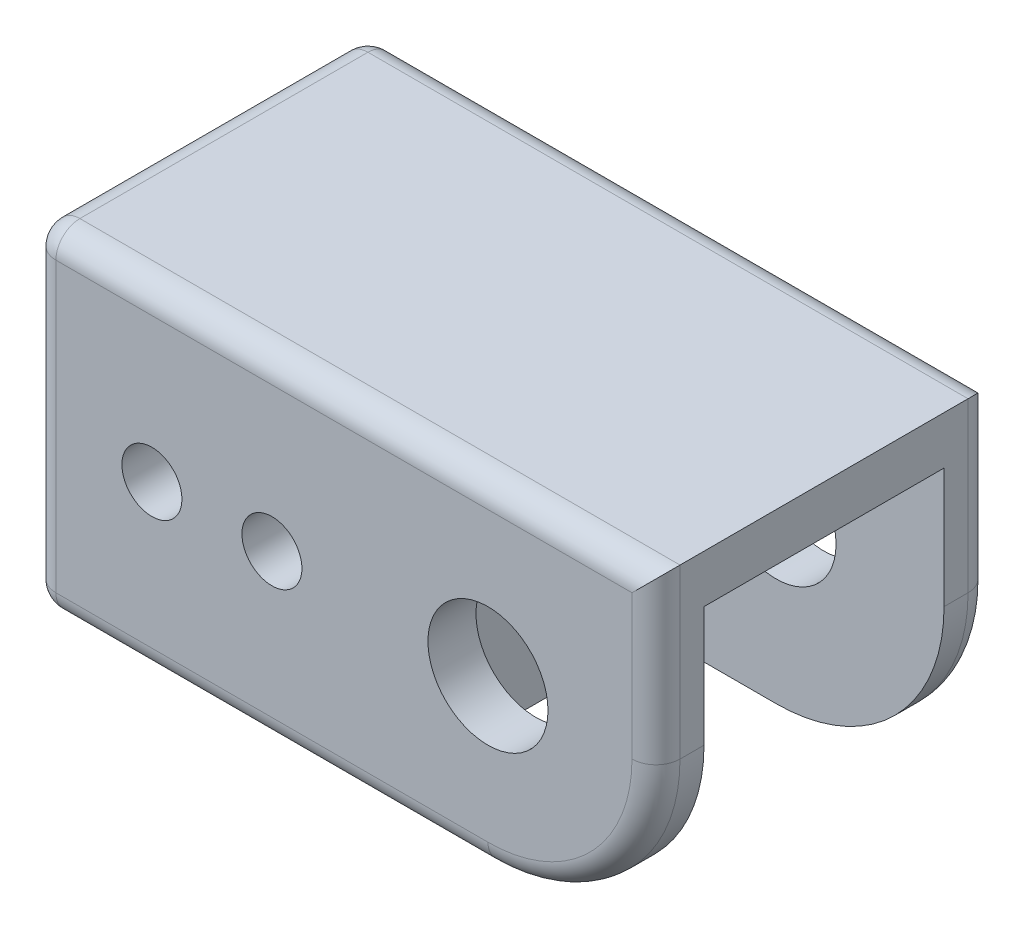
ISO-10303-21;
HEADER;
FILE_DESCRIPTION(('STEP AP214'),'2;1');
FILE_NAME('part.step','',(''),(''),'','','');
FILE_SCHEMA(('AUTOMOTIVE_DESIGN { 1 0 10303 214 1 1 1 1 }'));
ENDSEC;
DATA;
#1=APPLICATION_CONTEXT('core data for automotive mechanical design processes');
#2=APPLICATION_PROTOCOL_DEFINITION('international standard','automotive_design',2000,#1);
#3=PRODUCT_CONTEXT('',#1,'mechanical');
#4=PRODUCT('Part','Part','',(#3));
#5=PRODUCT_RELATED_PRODUCT_CATEGORY('part','',(#4));
#6=PRODUCT_DEFINITION_FORMATION('','',#4);
#7=PRODUCT_DEFINITION_CONTEXT('part definition',#1,'design');
#8=PRODUCT_DEFINITION('design','',#6,#7);
#9=PRODUCT_DEFINITION_SHAPE('','',#8);
#10=(LENGTH_UNIT() NAMED_UNIT(*) SI_UNIT(.MILLI.,.METRE.));
#11=(NAMED_UNIT(*) PLANE_ANGLE_UNIT() SI_UNIT($,.RADIAN.));
#12=(NAMED_UNIT(*) SI_UNIT($,.STERADIAN.) SOLID_ANGLE_UNIT());
#13=UNCERTAINTY_MEASURE_WITH_UNIT(LENGTH_MEASURE(1.E-05),#10,'distance_accuracy_value','');
#14=(GEOMETRIC_REPRESENTATION_CONTEXT(3) GLOBAL_UNCERTAINTY_ASSIGNED_CONTEXT((#13)) GLOBAL_UNIT_ASSIGNED_CONTEXT((#10,
#11,#12)) REPRESENTATION_CONTEXT('',''));
#15=CARTESIAN_POINT('',(0.,0.,0.));
#16=DIRECTION('',(0.,0.,1.));
#17=DIRECTION('',(1.,0.,0.));
#18=AXIS2_PLACEMENT_3D('',#15,#16,#17);
#19=CARTESIAN_POINT('',(-35.56,0.,35.56));
#20=DIRECTION('',(0.,0.,-1.));
#21=DIRECTION('',(-1.,0.,0.));
#22=AXIS2_PLACEMENT_3D('',#19,#20,#21);
#23=CYLINDRICAL_SURFACE('',#22,3.175);
#24=CARTESIAN_POINT('',(-35.56,0.,30.48));
#25=DIRECTION('',(0.,0.,1.));
#26=DIRECTION('',(0.,-1.,0.));
#27=AXIS2_PLACEMENT_3D('',#24,#25,#26);
#28=CIRCLE('',#27,3.175);
#29=CARTESIAN_POINT('',(-35.56,-3.175,30.48));
#30=VERTEX_POINT('',#29);
#31=EDGE_CURVE('E231',#30,#30,#28,.T.);
#32=ORIENTED_EDGE('',*,*,#31,.F.);
#33=EDGE_LOOP('',(#32));
#34=FACE_BOUND('',#33,.T.);
#35=CARTESIAN_POINT('',(-35.56,0.,35.56));
#36=DIRECTION('',(0.,0.,1.));
#37=DIRECTION('',(1.,0.,0.));
#38=AXIS2_PLACEMENT_3D('',#35,#36,#37);
#39=CIRCLE('',#38,3.175);
#40=CARTESIAN_POINT('',(-32.385,0.,35.56));
#41=VERTEX_POINT('',#40);
#42=EDGE_CURVE('E278',#41,#41,#39,.T.);
#43=ORIENTED_EDGE('',*,*,#42,.T.);
#44=EDGE_LOOP('',(#43));
#45=FACE_BOUND('',#44,.T.);
#46=ADVANCED_FACE('F36',(#34,#45),#23,.F.);
#47=CARTESIAN_POINT('',(-22.86,0.,35.56));
#48=DIRECTION('',(0.,0.,-1.));
#49=DIRECTION('',(-1.,0.,0.));
#50=AXIS2_PLACEMENT_3D('',#47,#48,#49);
#51=CYLINDRICAL_SURFACE('',#50,3.175);
#52=CARTESIAN_POINT('',(-22.86,0.,30.48));
#53=DIRECTION('',(0.,0.,1.));
#54=DIRECTION('',(0.,-1.,0.));
#55=AXIS2_PLACEMENT_3D('',#52,#53,#54);
#56=CIRCLE('',#55,3.175);
#57=CARTESIAN_POINT('',(-22.86,-3.175,30.48));
#58=VERTEX_POINT('',#57);
#59=EDGE_CURVE('E230',#58,#58,#56,.T.);
#60=ORIENTED_EDGE('',*,*,#59,.F.);
#61=EDGE_LOOP('',(#60));
#62=FACE_BOUND('',#61,.T.);
#63=CARTESIAN_POINT('',(-22.86,0.,35.56));
#64=DIRECTION('',(0.,0.,1.));
#65=DIRECTION('',(1.,0.,0.));
#66=AXIS2_PLACEMENT_3D('',#63,#64,#65);
#67=CIRCLE('',#66,3.175);
#68=CARTESIAN_POINT('',(-19.685,0.,35.56));
#69=VERTEX_POINT('',#68);
#70=EDGE_CURVE('E270',#69,#69,#67,.T.);
#71=ORIENTED_EDGE('',*,*,#70,.T.);
#72=EDGE_LOOP('',(#71));
#73=FACE_BOUND('',#72,.T.);
#74=ADVANCED_FACE('F504',(#62,#73),#51,.F.);
#75=CARTESIAN_POINT('',(0.,0.,35.56));
#76=DIRECTION('',(0.,0.,-1.));
#77=DIRECTION('',(-1.,0.,0.));
#78=AXIS2_PLACEMENT_3D('',#75,#76,#77);
#79=CYLINDRICAL_SURFACE('',#78,6.35);
#80=CARTESIAN_POINT('',(0.,0.,0.));
#81=DIRECTION('',(0.,0.,1.));
#82=DIRECTION('',(1.,0.,0.));
#83=AXIS2_PLACEMENT_3D('',#80,#81,#82);
#84=CIRCLE('',#83,6.35);
#85=CARTESIAN_POINT('',(6.35,0.,0.));
#86=VERTEX_POINT('',#85);
#87=EDGE_CURVE('E281',#86,#86,#84,.T.);
#88=ORIENTED_EDGE('',*,*,#87,.F.);
#89=EDGE_LOOP('',(#88));
#90=FACE_BOUND('',#89,.T.);
#91=CARTESIAN_POINT('',(0.,0.,5.08));
#92=DIRECTION('',(0.,0.,1.));
#93=DIRECTION('',(1.,0.,0.));
#94=AXIS2_PLACEMENT_3D('',#91,#92,#93);
#95=CIRCLE('',#94,6.35);
#96=CARTESIAN_POINT('',(6.35,0.,5.08));
#97=VERTEX_POINT('',#96);
#98=EDGE_CURVE('E269',#97,#97,#95,.T.);
#99=ORIENTED_EDGE('',*,*,#98,.T.);
#100=EDGE_LOOP('',(#99));
#101=FACE_BOUND('',#100,.T.);
#102=ADVANCED_FACE('F511',(#90,#101),#79,.F.);
#103=CARTESIAN_POINT('',(0.,0.,35.56));
#104=DIRECTION('',(0.,0.,-1.));
#105=DIRECTION('',(-1.,0.,0.));
#106=AXIS2_PLACEMENT_3D('',#103,#104,#105);
#107=PLANE('',#106);
#108=CARTESIAN_POINT('',(0.,0.,35.56));
#109=DIRECTION('',(0.,0.,-1.));
#110=DIRECTION('',(-1.,0.,0.));
#111=AXIS2_PLACEMENT_3D('',#108,#109,#110);
#112=CIRCLE('',#111,15.24);
#113=CARTESIAN_POINT('',(0.,-15.24,35.56));
#114=VERTEX_POINT('',#113);
#115=CARTESIAN_POINT('',(15.24,0.,35.56));
#116=VERTEX_POINT('',#115);
#117=EDGE_CURVE('E319',#114,#116,#112,.F.);
#118=ORIENTED_EDGE('',*,*,#117,.T.);
#119=DIRECTION('',(0.,1.,0.));
#120=VECTOR('',#119,1.);
#121=CARTESIAN_POINT('',(15.24,0.,35.56));
#122=LINE('',#121,#120);
#123=CARTESIAN_POINT('',(15.24,15.24,35.56));
#124=VERTEX_POINT('',#123);
#125=EDGE_CURVE('E321',#116,#124,#122,.T.);
#126=ORIENTED_EDGE('',*,*,#125,.T.);
#127=DIRECTION('',(-1.,0.,0.));
#128=VECTOR('',#127,1.);
#129=CARTESIAN_POINT('',(0.,15.24,35.56));
#130=LINE('',#129,#128);
#131=CARTESIAN_POINT('',(-45.72,15.24,35.56));
#132=VERTEX_POINT('',#131);
#133=EDGE_CURVE('E313',#124,#132,#130,.T.);
#134=ORIENTED_EDGE('',*,*,#133,.T.);
#135=DIRECTION('',(0.,-1.,0.));
#136=VECTOR('',#135,1.);
#137=CARTESIAN_POINT('',(-45.72,0.,35.56));
#138=LINE('',#137,#136);
#139=CARTESIAN_POINT('',(-45.72,-15.24,35.56));
#140=VERTEX_POINT('',#139);
#141=EDGE_CURVE('E315',#132,#140,#138,.T.);
#142=ORIENTED_EDGE('',*,*,#141,.T.);
#143=DIRECTION('',(1.,0.,0.));
#144=VECTOR('',#143,1.);
#145=CARTESIAN_POINT('',(0.,-15.24,35.56));
#146=LINE('',#145,#144);
#147=EDGE_CURVE('E317',#140,#114,#146,.T.);
#148=ORIENTED_EDGE('',*,*,#147,.T.);
#149=EDGE_LOOP('',(#118,#126,#134,#142,#148));
#150=FACE_BOUND('',#149,.T.);
#151=CARTESIAN_POINT('',(0.,0.,35.56));
#152=DIRECTION('',(0.,0.,1.));
#153=DIRECTION('',(1.,0.,0.));
#154=AXIS2_PLACEMENT_3D('',#151,#152,#153);
#155=CIRCLE('',#154,6.35);
#156=CARTESIAN_POINT('',(6.35,0.,35.56));
#157=VERTEX_POINT('',#156);
#158=EDGE_CURVE('E284',#157,#157,#155,.T.);
#159=ORIENTED_EDGE('',*,*,#158,.F.);
#160=EDGE_LOOP('',(#159));
#161=FACE_BOUND('',#160,.T.);
#162=ORIENTED_EDGE('',*,*,#42,.F.);
#163=EDGE_LOOP('',(#162));
#164=FACE_BOUND('',#163,.T.);
#165=ORIENTED_EDGE('',*,*,#70,.F.);
#166=EDGE_LOOP('',(#165));
#167=FACE_BOUND('',#166,.T.);
#168=ADVANCED_FACE('F467',(#150,#161,#164,#167),#107,.F.);
#169=CARTESIAN_POINT('',(0.,0.,0.));
#170=DIRECTION('',(0.,0.,-1.));
#171=DIRECTION('',(-1.,0.,0.));
#172=AXIS2_PLACEMENT_3D('',#169,#170,#171);
#173=PLANE('',#172);
#174=DIRECTION('',(-1.,0.,0.));
#175=VECTOR('',#174,1.);
#176=CARTESIAN_POINT('',(17.78,15.24,0.));
#177=LINE('',#176,#175);
#178=CARTESIAN_POINT('',(-45.72,15.24,0.));
#179=VERTEX_POINT('',#178);
#180=CARTESIAN_POINT('',(15.24,15.24,0.));
#181=VERTEX_POINT('',#180);
#182=EDGE_CURVE('E331',#179,#181,#177,.F.);
#183=ORIENTED_EDGE('',*,*,#182,.T.);
#184=DIRECTION('',(0.,1.,0.));
#185=VECTOR('',#184,1.);
#186=CARTESIAN_POINT('',(15.24,0.,0.));
#187=LINE('',#186,#185);
#188=CARTESIAN_POINT('',(15.24,0.,0.));
#189=VERTEX_POINT('',#188);
#190=EDGE_CURVE('E339',#181,#189,#187,.F.);
#191=ORIENTED_EDGE('',*,*,#190,.T.);
#192=CARTESIAN_POINT('',(0.,0.,0.));
#193=DIRECTION('',(0.,0.,-1.));
#194=DIRECTION('',(-1.,0.,0.));
#195=AXIS2_PLACEMENT_3D('',#192,#193,#194);
#196=CIRCLE('',#195,15.24);
#197=CARTESIAN_POINT('',(0.,-15.24,0.));
#198=VERTEX_POINT('',#197);
#199=EDGE_CURVE('E337',#189,#198,#196,.T.);
#200=ORIENTED_EDGE('',*,*,#199,.T.);
#201=DIRECTION('',(1.,0.,0.));
#202=VECTOR('',#201,1.);
#203=CARTESIAN_POINT('',(-48.26,-15.24,0.));
#204=LINE('',#203,#202);
#205=CARTESIAN_POINT('',(-45.72,-15.24,0.));
#206=VERTEX_POINT('',#205);
#207=EDGE_CURVE('E335',#198,#206,#204,.F.);
#208=ORIENTED_EDGE('',*,*,#207,.T.);
#209=DIRECTION('',(0.,-1.,0.));
#210=VECTOR('',#209,1.);
#211=CARTESIAN_POINT('',(-45.72,17.78,0.));
#212=LINE('',#211,#210);
#213=EDGE_CURVE('E333',#206,#179,#212,.F.);
#214=ORIENTED_EDGE('',*,*,#213,.T.);
#215=EDGE_LOOP('',(#183,#191,#200,#208,#214));
#216=FACE_BOUND('',#215,.T.);
#217=CARTESIAN_POINT('',(-35.56,0.,0.));
#218=DIRECTION('',(0.,0.,1.));
#219=DIRECTION('',(1.,0.,0.));
#220=AXIS2_PLACEMENT_3D('',#217,#218,#219);
#221=CIRCLE('',#220,3.175);
#222=CARTESIAN_POINT('',(-32.385,0.,0.));
#223=VERTEX_POINT('',#222);
#224=EDGE_CURVE('E273',#223,#223,#221,.T.);
#225=ORIENTED_EDGE('',*,*,#224,.T.);
#226=EDGE_LOOP('',(#225));
#227=FACE_BOUND('',#226,.T.);
#228=ORIENTED_EDGE('',*,*,#87,.T.);
#229=EDGE_LOOP('',(#228));
#230=FACE_BOUND('',#229,.T.);
#231=CARTESIAN_POINT('',(-22.86,0.,0.));
#232=DIRECTION('',(0.,0.,1.));
#233=DIRECTION('',(1.,0.,0.));
#234=AXIS2_PLACEMENT_3D('',#231,#232,#233);
#235=CIRCLE('',#234,3.175);
#236=CARTESIAN_POINT('',(-19.685,0.,0.));
#237=VERTEX_POINT('',#236);
#238=EDGE_CURVE('E274',#237,#237,#235,.T.);
#239=ORIENTED_EDGE('',*,*,#238,.T.);
#240=EDGE_LOOP('',(#239));
#241=FACE_BOUND('',#240,.T.);
#242=ADVANCED_FACE('F531',(#216,#227,#230,#241),#173,.T.);
#243=CARTESIAN_POINT('',(-48.26,17.78,35.56));
#244=DIRECTION('',(0.,-1.,0.));
#245=DIRECTION('',(1.,0.,0.));
#246=AXIS2_PLACEMENT_3D('',#243,#244,#245);
#247=PLANE('',#246);
#248=DIRECTION('',(0.,0.,-1.));
#249=VECTOR('',#248,1.);
#250=CARTESIAN_POINT('',(17.78,17.78,35.56));
#251=LINE('',#250,#249);
#252=CARTESIAN_POINT('',(17.78,17.78,33.02));
#253=VERTEX_POINT('',#252);
#254=CARTESIAN_POINT('',(17.78,17.78,2.54));
#255=VERTEX_POINT('',#254);
#256=EDGE_CURVE('E287',#253,#255,#251,.T.);
#257=ORIENTED_EDGE('',*,*,#256,.T.);
#258=DIRECTION('',(-1.,0.,0.));
#259=VECTOR('',#258,1.);
#260=CARTESIAN_POINT('',(-48.26,17.78,2.54));
#261=LINE('',#260,#259);
#262=CARTESIAN_POINT('',(-45.72,17.78,2.54));
#263=VERTEX_POINT('',#262);
#264=EDGE_CURVE('E11',#255,#263,#261,.T.);
#265=ORIENTED_EDGE('',*,*,#264,.T.);
#266=DIRECTION('',(0.,0.,-1.));
#267=VECTOR('',#266,1.);
#268=CARTESIAN_POINT('',(-45.72,17.78,35.56));
#269=LINE('',#268,#267);
#270=CARTESIAN_POINT('',(-45.72,17.78,33.02));
#271=VERTEX_POINT('',#270);
#272=EDGE_CURVE('E45',#263,#271,#269,.F.);
#273=ORIENTED_EDGE('',*,*,#272,.T.);
#274=DIRECTION('',(-1.,0.,0.));
#275=VECTOR('',#274,1.);
#276=CARTESIAN_POINT('',(-48.26,17.78,33.02));
#277=LINE('',#276,#275);
#278=EDGE_CURVE('E359',#271,#253,#277,.F.);
#279=ORIENTED_EDGE('',*,*,#278,.T.);
#280=EDGE_LOOP('',(#257,#265,#273,#279));
#281=FACE_BOUND('',#280,.T.);
#282=ADVANCED_FACE('F534',(#281),#247,.F.);
#283=CARTESIAN_POINT('',(-48.26,17.78,35.56));
#284=DIRECTION('',(1.,0.,0.));
#285=DIRECTION('',(0.,1.,0.));
#286=AXIS2_PLACEMENT_3D('',#283,#284,#285);
#287=PLANE('',#286);
#288=DIRECTION('',(0.,-1.,0.));
#289=VECTOR('',#288,1.);
#290=CARTESIAN_POINT('',(-48.26,-17.78,2.54));
#291=LINE('',#290,#289);
#292=CARTESIAN_POINT('',(-48.26,15.24,2.54));
#293=VERTEX_POINT('',#292);
#294=CARTESIAN_POINT('',(-48.26,-15.24,2.54));
#295=VERTEX_POINT('',#294);
#296=EDGE_CURVE('E354',#293,#295,#291,.T.);
#297=ORIENTED_EDGE('',*,*,#296,.T.);
#298=DIRECTION('',(0.,0.,-1.));
#299=VECTOR('',#298,1.);
#300=CARTESIAN_POINT('',(-48.26,-15.24,35.56));
#301=LINE('',#300,#299);
#302=CARTESIAN_POINT('',(-48.26,-15.24,33.02));
#303=VERTEX_POINT('',#302);
#304=EDGE_CURVE('E356',#295,#303,#301,.F.);
#305=ORIENTED_EDGE('',*,*,#304,.T.);
#306=DIRECTION('',(0.,-1.,0.));
#307=VECTOR('',#306,1.);
#308=CARTESIAN_POINT('',(-48.26,17.78,33.02));
#309=LINE('',#308,#307);
#310=CARTESIAN_POINT('',(-48.26,15.24,33.02));
#311=VERTEX_POINT('',#310);
#312=EDGE_CURVE('E350',#303,#311,#309,.F.);
#313=ORIENTED_EDGE('',*,*,#312,.T.);
#314=DIRECTION('',(0.,0.,-1.));
#315=VECTOR('',#314,1.);
#316=CARTESIAN_POINT('',(-48.26,15.24,35.56));
#317=LINE('',#316,#315);
#318=EDGE_CURVE('E352',#311,#293,#317,.T.);
#319=ORIENTED_EDGE('',*,*,#318,.T.);
#320=EDGE_LOOP('',(#297,#305,#313,#319));
#321=FACE_BOUND('',#320,.T.);
#322=DIRECTION('',(0.,0.,-1.));
#323=VECTOR('',#322,1.);
#324=CARTESIAN_POINT('',(-48.26,12.7,5.08));
#325=LINE('',#324,#323);
#326=CARTESIAN_POINT('',(-48.26,12.7,30.48));
#327=VERTEX_POINT('',#326);
#328=CARTESIAN_POINT('',(-48.26,12.7,5.08));
#329=VERTEX_POINT('',#328);
#330=EDGE_CURVE('E217',#327,#329,#325,.T.);
#331=ORIENTED_EDGE('',*,*,#330,.F.);
#332=DIRECTION('',(0.,1.,0.));
#333=VECTOR('',#332,1.);
#334=CARTESIAN_POINT('',(-48.26,12.7,30.48));
#335=LINE('',#334,#333);
#336=CARTESIAN_POINT('',(-48.26,-12.7,30.48));
#337=VERTEX_POINT('',#336);
#338=EDGE_CURVE('E191',#337,#327,#335,.T.);
#339=ORIENTED_EDGE('',*,*,#338,.F.);
#340=DIRECTION('',(0.,0.,1.));
#341=VECTOR('',#340,1.);
#342=CARTESIAN_POINT('',(-48.26,-12.7,5.08));
#343=LINE('',#342,#341);
#344=CARTESIAN_POINT('',(-48.26,-12.7,5.08));
#345=VERTEX_POINT('',#344);
#346=EDGE_CURVE('E208',#345,#337,#343,.T.);
#347=ORIENTED_EDGE('',*,*,#346,.F.);
#348=DIRECTION('',(0.,-1.,0.));
#349=VECTOR('',#348,1.);
#350=CARTESIAN_POINT('',(-48.26,12.7,5.08));
#351=LINE('',#350,#349);
#352=EDGE_CURVE('E211',#329,#345,#351,.T.);
#353=ORIENTED_EDGE('',*,*,#352,.F.);
#354=EDGE_LOOP('',(#331,#339,#347,#353));
#355=FACE_BOUND('',#354,.T.);
#356=ADVANCED_FACE('F477',(#321,#355),#287,.F.);
#357=CARTESIAN_POINT('',(-48.26,-17.78,35.56));
#358=DIRECTION('',(0.,1.,0.));
#359=DIRECTION('',(-1.,0.,0.));
#360=AXIS2_PLACEMENT_3D('',#357,#358,#359);
#361=PLANE('',#360);
#362=DIRECTION('',(0.,0.,-1.));
#363=VECTOR('',#362,1.);
#364=CARTESIAN_POINT('',(0.,-17.78,35.56));
#365=LINE('',#364,#363);
#366=CARTESIAN_POINT('',(0.,-17.78,30.48));
#367=VERTEX_POINT('',#366);
#368=CARTESIAN_POINT('',(0.,-17.78,33.02));
#369=VERTEX_POINT('',#368);
#370=EDGE_CURVE('E308',#367,#369,#365,.F.);
#371=ORIENTED_EDGE('',*,*,#370,.T.);
#372=DIRECTION('',(1.,0.,0.));
#373=VECTOR('',#372,1.);
#374=CARTESIAN_POINT('',(-48.26,-17.78,33.02));
#375=LINE('',#374,#373);
#376=CARTESIAN_POINT('',(-45.72,-17.78,33.02));
#377=VERTEX_POINT('',#376);
#378=EDGE_CURVE('E348',#369,#377,#375,.F.);
#379=ORIENTED_EDGE('',*,*,#378,.T.);
#380=DIRECTION('',(0.,0.,-1.));
#381=VECTOR('',#380,1.);
#382=CARTESIAN_POINT('',(-45.72,-17.78,35.56));
#383=LINE('',#382,#381);
#384=CARTESIAN_POINT('',(-45.72,-17.78,2.54));
#385=VERTEX_POINT('',#384);
#386=EDGE_CURVE('E344',#377,#385,#383,.T.);
#387=ORIENTED_EDGE('',*,*,#386,.T.);
#388=DIRECTION('',(1.,0.,0.));
#389=VECTOR('',#388,1.);
#390=CARTESIAN_POINT('',(0.,-17.78,2.54));
#391=LINE('',#390,#389);
#392=CARTESIAN_POINT('',(0.,-17.78,2.54));
#393=VERTEX_POINT('',#392);
#394=EDGE_CURVE('E346',#385,#393,#391,.T.);
#395=ORIENTED_EDGE('',*,*,#394,.T.);
#396=DIRECTION('',(0.,0.,-1.));
#397=VECTOR('',#396,1.);
#398=CARTESIAN_POINT('',(0.,-17.78,35.56));
#399=LINE('',#398,#397);
#400=CARTESIAN_POINT('',(0.,-17.78,5.08));
#401=VERTEX_POINT('',#400);
#402=EDGE_CURVE('E306',#393,#401,#399,.F.);
#403=ORIENTED_EDGE('',*,*,#402,.T.);
#404=DIRECTION('',(1.,0.,0.));
#405=VECTOR('',#404,1.);
#406=CARTESIAN_POINT('',(17.78,-17.78,5.08));
#407=LINE('',#406,#405);
#408=CARTESIAN_POINT('',(-12.7,-17.78,5.08));
#409=VERTEX_POINT('',#408);
#410=EDGE_CURVE('E240',#409,#401,#407,.T.);
#411=ORIENTED_EDGE('',*,*,#410,.F.);
#412=DIRECTION('',(0.,0.,-1.));
#413=VECTOR('',#412,1.);
#414=CARTESIAN_POINT('',(-12.7,-17.78,30.48));
#415=LINE('',#414,#413);
#416=CARTESIAN_POINT('',(-12.7,-17.78,30.48));
#417=VERTEX_POINT('',#416);
#418=EDGE_CURVE('E265',#417,#409,#415,.T.);
#419=ORIENTED_EDGE('',*,*,#418,.F.);
#420=DIRECTION('',(1.,0.,0.));
#421=VECTOR('',#420,1.);
#422=CARTESIAN_POINT('',(17.78,-17.78,30.48));
#423=LINE('',#422,#421);
#424=EDGE_CURVE('E253',#417,#367,#423,.T.);
#425=ORIENTED_EDGE('',*,*,#424,.T.);
#426=EDGE_LOOP('',(#371,#379,#387,#395,#403,#411,#419,#425));
#427=FACE_BOUND('',#426,.T.);
#428=ADVANCED_FACE('F449',(#427),#361,.F.);
#429=CARTESIAN_POINT('',(17.78,17.78,35.56));
#430=DIRECTION('',(-1.,0.,0.));
#431=DIRECTION('',(0.,-1.,0.));
#432=AXIS2_PLACEMENT_3D('',#429,#430,#431);
#433=PLANE('',#432);
#434=ORIENTED_EDGE('',*,*,#256,.F.);
#435=DIRECTION('',(0.,1.,0.));
#436=VECTOR('',#435,1.);
#437=CARTESIAN_POINT('',(17.78,17.78,33.02));
#438=LINE('',#437,#436);
#439=CARTESIAN_POINT('',(17.78,0.,33.02));
#440=VERTEX_POINT('',#439);
#441=EDGE_CURVE('E326',#253,#440,#438,.F.);
#442=ORIENTED_EDGE('',*,*,#441,.T.);
#443=DIRECTION('',(0.,0.,-1.));
#444=VECTOR('',#443,1.);
#445=CARTESIAN_POINT('',(17.78,0.,35.56));
#446=LINE('',#445,#444);
#447=CARTESIAN_POINT('',(17.78,0.,30.48));
#448=VERTEX_POINT('',#447);
#449=EDGE_CURVE('E302',#440,#448,#446,.T.);
#450=ORIENTED_EDGE('',*,*,#449,.T.);
#451=DIRECTION('',(0.,1.,0.));
#452=VECTOR('',#451,1.);
#453=CARTESIAN_POINT('',(17.78,12.7,30.48));
#454=LINE('',#453,#452);
#455=CARTESIAN_POINT('',(17.78,12.7,30.48));
#456=VERTEX_POINT('',#455);
#457=EDGE_CURVE('E256',#448,#456,#454,.T.);
#458=ORIENTED_EDGE('',*,*,#457,.T.);
#459=DIRECTION('',(0.,0.,-1.));
#460=VECTOR('',#459,1.);
#461=CARTESIAN_POINT('',(17.78,12.7,30.48));
#462=LINE('',#461,#460);
#463=CARTESIAN_POINT('',(17.78,12.7,5.08));
#464=VERTEX_POINT('',#463);
#465=EDGE_CURVE('E262',#456,#464,#462,.T.);
#466=ORIENTED_EDGE('',*,*,#465,.T.);
#467=DIRECTION('',(0.,1.,0.));
#468=VECTOR('',#467,1.);
#469=CARTESIAN_POINT('',(17.78,12.7,5.08));
#470=LINE('',#469,#468);
#471=CARTESIAN_POINT('',(17.78,0.,5.08));
#472=VERTEX_POINT('',#471);
#473=EDGE_CURVE('E243',#472,#464,#470,.T.);
#474=ORIENTED_EDGE('',*,*,#473,.F.);
#475=DIRECTION('',(0.,0.,-1.));
#476=VECTOR('',#475,1.);
#477=CARTESIAN_POINT('',(17.78,0.,35.56));
#478=LINE('',#477,#476);
#479=CARTESIAN_POINT('',(17.78,0.,2.54));
#480=VERTEX_POINT('',#479);
#481=EDGE_CURVE('E291',#472,#480,#478,.T.);
#482=ORIENTED_EDGE('',*,*,#481,.T.);
#483=DIRECTION('',(0.,1.,0.));
#484=VECTOR('',#483,1.);
#485=CARTESIAN_POINT('',(17.78,17.78,2.54));
#486=LINE('',#485,#484);
#487=EDGE_CURVE('E324',#480,#255,#486,.T.);
#488=ORIENTED_EDGE('',*,*,#487,.T.);
#489=EDGE_LOOP('',(#434,#442,#450,#458,#466,#474,#482,#488));
#490=FACE_BOUND('',#489,.T.);
#491=ADVANCED_FACE('F430',(#490),#433,.F.);
#492=CARTESIAN_POINT('',(0.,0.,30.48));
#493=DIRECTION('',(0.,0.,1.));
#494=DIRECTION('',(1.,0.,0.));
#495=AXIS2_PLACEMENT_3D('',#492,#493,#494);
#496=CIRCLE('',#495,6.35);
#497=CARTESIAN_POINT('',(6.35,0.,30.48));
#498=VERTEX_POINT('',#497);
#499=EDGE_CURVE('E277',#498,#498,#496,.T.);
#500=ORIENTED_EDGE('',*,*,#499,.F.);
#501=EDGE_LOOP('',(#500));
#502=FACE_BOUND('',#501,.T.);
#503=ORIENTED_EDGE('',*,*,#158,.T.);
#504=EDGE_LOOP('',(#503));
#505=FACE_BOUND('',#504,.T.);
#506=ADVANCED_FACE('F519',(#502,#505),#79,.F.);
#507=CARTESIAN_POINT('',(-35.56,0.,5.08));
#508=DIRECTION('',(0.,0.,-1.));
#509=DIRECTION('',(0.,1.,0.));
#510=AXIS2_PLACEMENT_3D('',#507,#508,#509);
#511=CIRCLE('',#510,3.175);
#512=CARTESIAN_POINT('',(-35.56,3.17499999999999,5.08));
#513=VERTEX_POINT('',#512);
#514=EDGE_CURVE('E227',#513,#513,#511,.T.);
#515=ORIENTED_EDGE('',*,*,#514,.F.);
#516=EDGE_LOOP('',(#515));
#517=FACE_BOUND('',#516,.T.);
#518=ORIENTED_EDGE('',*,*,#224,.F.);
#519=EDGE_LOOP('',(#518));
#520=FACE_BOUND('',#519,.T.);
#521=ADVANCED_FACE('F507',(#517,#520),#23,.F.);
#522=CARTESIAN_POINT('',(-22.86,0.,5.08));
#523=DIRECTION('',(0.,0.,-1.));
#524=DIRECTION('',(0.,1.,0.));
#525=AXIS2_PLACEMENT_3D('',#522,#523,#524);
#526=CIRCLE('',#525,3.175);
#527=CARTESIAN_POINT('',(-22.86,3.175,5.08));
#528=VERTEX_POINT('',#527);
#529=EDGE_CURVE('E223',#528,#528,#526,.T.);
#530=ORIENTED_EDGE('',*,*,#529,.F.);
#531=EDGE_LOOP('',(#530));
#532=FACE_BOUND('',#531,.T.);
#533=ORIENTED_EDGE('',*,*,#238,.F.);
#534=EDGE_LOOP('',(#533));
#535=FACE_BOUND('',#534,.T.);
#536=ADVANCED_FACE('F514',(#532,#535),#51,.F.);
#537=CARTESIAN_POINT('',(0.,0.,30.48));
#538=DIRECTION('',(0.,0.,-1.));
#539=DIRECTION('',(-1.,0.,0.));
#540=AXIS2_PLACEMENT_3D('',#537,#538,#539);
#541=CYLINDRICAL_SURFACE('',#540,12.7);
#542=DIRECTION('',(0.,0.,-1.));
#543=VECTOR('',#542,1.);
#544=CARTESIAN_POINT('',(0.,12.7,30.48));
#545=LINE('',#544,#543);
#546=CARTESIAN_POINT('',(0.,12.7,30.48));
#547=VERTEX_POINT('',#546);
#548=CARTESIAN_POINT('',(0.,12.7,5.08));
#549=VERTEX_POINT('',#548);
#550=EDGE_CURVE('E260',#547,#549,#545,.T.);
#551=ORIENTED_EDGE('',*,*,#550,.F.);
#552=CARTESIAN_POINT('',(0.,0.,30.48));
#553=DIRECTION('',(0.,0.,1.));
#554=DIRECTION('',(1.,0.,0.));
#555=AXIS2_PLACEMENT_3D('',#552,#553,#554);
#556=CIRCLE('',#555,12.7);
#557=CARTESIAN_POINT('',(-12.7,0.,30.48));
#558=VERTEX_POINT('',#557);
#559=EDGE_CURVE('E248',#547,#558,#556,.T.);
#560=ORIENTED_EDGE('',*,*,#559,.T.);
#561=DIRECTION('',(0.,0.,-1.));
#562=VECTOR('',#561,1.);
#563=CARTESIAN_POINT('',(-12.7,0.,30.48));
#564=LINE('',#563,#562);
#565=CARTESIAN_POINT('',(-12.7,0.,5.08));
#566=VERTEX_POINT('',#565);
#567=EDGE_CURVE('E267',#558,#566,#564,.T.);
#568=ORIENTED_EDGE('',*,*,#567,.T.);
#569=CARTESIAN_POINT('',(0.,0.,5.08));
#570=DIRECTION('',(0.,0.,1.));
#571=DIRECTION('',(1.,0.,0.));
#572=AXIS2_PLACEMENT_3D('',#569,#570,#571);
#573=CIRCLE('',#572,12.7);
#574=EDGE_CURVE('E234',#549,#566,#573,.T.);
#575=ORIENTED_EDGE('',*,*,#574,.F.);
#576=EDGE_LOOP('',(#551,#560,#568,#575));
#577=FACE_BOUND('',#576,.T.);
#578=ADVANCED_FACE('F442',(#577),#541,.F.);
#579=CARTESIAN_POINT('',(-12.7,-17.78,30.48));
#580=DIRECTION('',(1.,0.,0.));
#581=DIRECTION('',(0.,1.,0.));
#582=AXIS2_PLACEMENT_3D('',#579,#580,#581);
#583=PLANE('',#582);
#584=ORIENTED_EDGE('',*,*,#567,.F.);
#585=DIRECTION('',(0.,-1.,0.));
#586=VECTOR('',#585,1.);
#587=CARTESIAN_POINT('',(-12.7,-17.78,30.48));
#588=LINE('',#587,#586);
#589=EDGE_CURVE('E251',#558,#417,#588,.T.);
#590=ORIENTED_EDGE('',*,*,#589,.T.);
#591=ORIENTED_EDGE('',*,*,#418,.T.);
#592=DIRECTION('',(0.,-1.,0.));
#593=VECTOR('',#592,1.);
#594=CARTESIAN_POINT('',(-12.7,-17.78,5.08));
#595=LINE('',#594,#593);
#596=EDGE_CURVE('E237',#566,#409,#595,.T.);
#597=ORIENTED_EDGE('',*,*,#596,.F.);
#598=EDGE_LOOP('',(#584,#590,#591,#597));
#599=FACE_BOUND('',#598,.T.);
#600=ADVANCED_FACE('F562',(#599),#583,.T.);
#601=CARTESIAN_POINT('',(0.,12.7,30.48));
#602=DIRECTION('',(0.,-1.,0.));
#603=DIRECTION('',(0.,0.,-1.));
#604=AXIS2_PLACEMENT_3D('',#601,#602,#603);
#605=PLANE('',#604);
#606=ORIENTED_EDGE('',*,*,#465,.F.);
#607=DIRECTION('',(-1.,0.,0.));
#608=VECTOR('',#607,1.);
#609=CARTESIAN_POINT('',(0.,12.7,30.48));
#610=LINE('',#609,#608);
#611=EDGE_CURVE('E258',#456,#547,#610,.T.);
#612=ORIENTED_EDGE('',*,*,#611,.T.);
#613=ORIENTED_EDGE('',*,*,#550,.T.);
#614=DIRECTION('',(-1.,0.,0.));
#615=VECTOR('',#614,1.);
#616=CARTESIAN_POINT('',(0.,12.7,5.08));
#617=LINE('',#616,#615);
#618=EDGE_CURVE('E245',#464,#549,#617,.T.);
#619=ORIENTED_EDGE('',*,*,#618,.F.);
#620=EDGE_LOOP('',(#606,#612,#613,#619));
#621=FACE_BOUND('',#620,.T.);
#622=ADVANCED_FACE('F436',(#621),#605,.T.);
#623=CARTESIAN_POINT('',(0.,0.,30.48));
#624=DIRECTION('',(0.,0.,1.));
#625=DIRECTION('',(1.,0.,0.));
#626=AXIS2_PLACEMENT_3D('',#623,#624,#625);
#627=PLANE('',#626);
#628=ORIENTED_EDGE('',*,*,#499,.T.);
#629=EDGE_LOOP('',(#628));
#630=FACE_BOUND('',#629,.T.);
#631=ORIENTED_EDGE('',*,*,#457,.F.);
#632=CARTESIAN_POINT('',(0.,0.,30.48));
#633=DIRECTION('',(0.,0.,1.));
#634=DIRECTION('',(1.,0.,0.));
#635=AXIS2_PLACEMENT_3D('',#632,#633,#634);
#636=CIRCLE('',#635,17.78);
#637=EDGE_CURVE('E304',#448,#367,#636,.F.);
#638=ORIENTED_EDGE('',*,*,#637,.T.);
#639=ORIENTED_EDGE('',*,*,#424,.F.);
#640=ORIENTED_EDGE('',*,*,#589,.F.);
#641=ORIENTED_EDGE('',*,*,#559,.F.);
#642=ORIENTED_EDGE('',*,*,#611,.F.);
#643=EDGE_LOOP('',(#631,#638,#639,#640,#641,#642));
#644=FACE_BOUND('',#643,.T.);
#645=ADVANCED_FACE('F547',(#630,#644),#627,.F.);
#646=CARTESIAN_POINT('',(0.,0.,5.08));
#647=DIRECTION('',(0.,0.,1.));
#648=DIRECTION('',(1.,0.,0.));
#649=AXIS2_PLACEMENT_3D('',#646,#647,#648);
#650=PLANE('',#649);
#651=ORIENTED_EDGE('',*,*,#98,.F.);
#652=EDGE_LOOP('',(#651));
#653=FACE_BOUND('',#652,.T.);
#654=ORIENTED_EDGE('',*,*,#410,.T.);
#655=CARTESIAN_POINT('',(0.,0.,5.08));
#656=DIRECTION('',(0.,0.,1.));
#657=DIRECTION('',(1.,0.,0.));
#658=AXIS2_PLACEMENT_3D('',#655,#656,#657);
#659=CIRCLE('',#658,17.78);
#660=EDGE_CURVE('E311',#401,#472,#659,.T.);
#661=ORIENTED_EDGE('',*,*,#660,.T.);
#662=ORIENTED_EDGE('',*,*,#473,.T.);
#663=ORIENTED_EDGE('',*,*,#618,.T.);
#664=ORIENTED_EDGE('',*,*,#574,.T.);
#665=ORIENTED_EDGE('',*,*,#596,.T.);
#666=EDGE_LOOP('',(#654,#661,#662,#663,#664,#665));
#667=FACE_BOUND('',#666,.T.);
#668=ADVANCED_FACE('F434',(#653,#667),#650,.T.);
#669=CARTESIAN_POINT('',(-15.24,12.7,30.48));
#670=DIRECTION('',(0.,0.,1.));
#671=DIRECTION('',(0.,-1.,0.));
#672=AXIS2_PLACEMENT_3D('',#669,#670,#671);
#673=PLANE('',#672);
#674=ORIENTED_EDGE('',*,*,#31,.T.);
#675=EDGE_LOOP('',(#674));
#676=FACE_BOUND('',#675,.T.);
#677=ORIENTED_EDGE('',*,*,#59,.T.);
#678=EDGE_LOOP('',(#677));
#679=FACE_BOUND('',#678,.T.);
#680=ORIENTED_EDGE('',*,*,#338,.T.);
#681=DIRECTION('',(-1.,0.,0.));
#682=VECTOR('',#681,1.);
#683=CARTESIAN_POINT('',(-15.24,12.7,30.48));
#684=LINE('',#683,#682);
#685=CARTESIAN_POINT('',(-15.24,12.7,30.48));
#686=VERTEX_POINT('',#685);
#687=EDGE_CURVE('E184',#686,#327,#684,.T.);
#688=ORIENTED_EDGE('',*,*,#687,.F.);
#689=DIRECTION('',(0.,1.,0.));
#690=VECTOR('',#689,1.);
#691=CARTESIAN_POINT('',(-15.24,12.7,30.48));
#692=LINE('',#691,#690);
#693=CARTESIAN_POINT('',(-15.24,-12.7,30.48));
#694=VERTEX_POINT('',#693);
#695=EDGE_CURVE('E188',#694,#686,#692,.T.);
#696=ORIENTED_EDGE('',*,*,#695,.F.);
#697=DIRECTION('',(-1.,0.,0.));
#698=VECTOR('',#697,1.);
#699=CARTESIAN_POINT('',(-15.24,-12.7,30.48));
#700=LINE('',#699,#698);
#701=EDGE_CURVE('E221',#694,#337,#700,.T.);
#702=ORIENTED_EDGE('',*,*,#701,.T.);
#703=EDGE_LOOP('',(#680,#688,#696,#702));
#704=FACE_BOUND('',#703,.T.);
#705=ADVANCED_FACE('F186',(#676,#679,#704),#673,.F.);
#706=CARTESIAN_POINT('',(-15.24,-12.7,5.08));
#707=DIRECTION('',(0.,-1.,0.));
#708=DIRECTION('',(1.,0.,0.));
#709=AXIS2_PLACEMENT_3D('',#706,#707,#708);
#710=PLANE('',#709);
#711=ORIENTED_EDGE('',*,*,#346,.T.);
#712=ORIENTED_EDGE('',*,*,#701,.F.);
#713=DIRECTION('',(0.,0.,1.));
#714=VECTOR('',#713,1.);
#715=CARTESIAN_POINT('',(-15.24,-12.7,5.08));
#716=LINE('',#715,#714);
#717=CARTESIAN_POINT('',(-15.24,-12.7,5.08));
#718=VERTEX_POINT('',#717);
#719=EDGE_CURVE('E196',#718,#694,#716,.T.);
#720=ORIENTED_EDGE('',*,*,#719,.F.);
#721=DIRECTION('',(-1.,0.,0.));
#722=VECTOR('',#721,1.);
#723=CARTESIAN_POINT('',(-15.24,-12.7,5.08));
#724=LINE('',#723,#722);
#725=EDGE_CURVE('E224',#718,#345,#724,.T.);
#726=ORIENTED_EDGE('',*,*,#725,.T.);
#727=EDGE_LOOP('',(#711,#712,#720,#726));
#728=FACE_BOUND('',#727,.T.);
#729=ADVANCED_FACE('F553',(#728),#710,.F.);
#730=CARTESIAN_POINT('',(-15.24,12.7,5.08));
#731=DIRECTION('',(0.,0.,-1.));
#732=DIRECTION('',(0.,1.,0.));
#733=AXIS2_PLACEMENT_3D('',#730,#731,#732);
#734=PLANE('',#733);
#735=ORIENTED_EDGE('',*,*,#514,.T.);
#736=EDGE_LOOP('',(#735));
#737=FACE_BOUND('',#736,.T.);
#738=ORIENTED_EDGE('',*,*,#529,.T.);
#739=EDGE_LOOP('',(#738));
#740=FACE_BOUND('',#739,.T.);
#741=ORIENTED_EDGE('',*,*,#352,.T.);
#742=ORIENTED_EDGE('',*,*,#725,.F.);
#743=DIRECTION('',(0.,-1.,0.));
#744=VECTOR('',#743,1.);
#745=CARTESIAN_POINT('',(-15.24,12.7,5.08));
#746=LINE('',#745,#744);
#747=CARTESIAN_POINT('',(-15.24,12.7,5.08));
#748=VERTEX_POINT('',#747);
#749=EDGE_CURVE('E204',#748,#718,#746,.T.);
#750=ORIENTED_EDGE('',*,*,#749,.F.);
#751=DIRECTION('',(-1.,0.,0.));
#752=VECTOR('',#751,1.);
#753=CARTESIAN_POINT('',(-15.24,12.7,5.08));
#754=LINE('',#753,#752);
#755=EDGE_CURVE('E195',#748,#329,#754,.T.);
#756=ORIENTED_EDGE('',*,*,#755,.T.);
#757=EDGE_LOOP('',(#741,#742,#750,#756));
#758=FACE_BOUND('',#757,.T.);
#759=ADVANCED_FACE('F807',(#737,#740,#758),#734,.F.);
#760=CARTESIAN_POINT('',(-15.24,12.7,5.08));
#761=DIRECTION('',(0.,1.,0.));
#762=DIRECTION('',(-1.,0.,0.));
#763=AXIS2_PLACEMENT_3D('',#760,#761,#762);
#764=PLANE('',#763);
#765=ORIENTED_EDGE('',*,*,#330,.T.);
#766=ORIENTED_EDGE('',*,*,#755,.F.);
#767=DIRECTION('',(0.,0.,-1.));
#768=VECTOR('',#767,1.);
#769=CARTESIAN_POINT('',(-15.24,12.7,5.08));
#770=LINE('',#769,#768);
#771=EDGE_CURVE('E199',#686,#748,#770,.T.);
#772=ORIENTED_EDGE('',*,*,#771,.F.);
#773=ORIENTED_EDGE('',*,*,#687,.T.);
#774=EDGE_LOOP('',(#765,#766,#772,#773));
#775=FACE_BOUND('',#774,.T.);
#776=ADVANCED_FACE('F200',(#775),#764,.F.);
#777=CARTESIAN_POINT('',(-15.24,0.,0.));
#778=DIRECTION('',(-1.,0.,0.));
#779=DIRECTION('',(0.,0.,1.));
#780=AXIS2_PLACEMENT_3D('',#777,#778,#779);
#781=PLANE('',#780);
#782=ORIENTED_EDGE('',*,*,#695,.T.);
#783=ORIENTED_EDGE('',*,*,#771,.T.);
#784=ORIENTED_EDGE('',*,*,#749,.T.);
#785=ORIENTED_EDGE('',*,*,#719,.T.);
#786=EDGE_LOOP('',(#782,#783,#784,#785));
#787=FACE_BOUND('',#786,.T.);
#788=ADVANCED_FACE('F206',(#787),#781,.T.);
#789=CARTESIAN_POINT('',(0.,0.,35.56));
#790=DIRECTION('',(0.,0.,-1.));
#791=DIRECTION('',(-1.,0.,0.));
#792=AXIS2_PLACEMENT_3D('',#789,#790,#791);
#793=CYLINDRICAL_SURFACE('',#792,17.78);
#794=ORIENTED_EDGE('',*,*,#449,.F.);
#795=CARTESIAN_POINT('',(0.,0.,33.02));
#796=DIRECTION('',(0.,0.,-1.));
#797=DIRECTION('',(-1.,0.,0.));
#798=AXIS2_PLACEMENT_3D('',#795,#796,#797);
#799=CIRCLE('',#798,17.78);
#800=EDGE_CURVE('E329',#440,#369,#799,.T.);
#801=ORIENTED_EDGE('',*,*,#800,.T.);
#802=ORIENTED_EDGE('',*,*,#370,.F.);
#803=ORIENTED_EDGE('',*,*,#637,.F.);
#804=EDGE_LOOP('',(#794,#801,#802,#803));
#805=FACE_BOUND('',#804,.T.);
#806=ADVANCED_FACE('F645',(#805),#793,.T.);
#807=CARTESIAN_POINT('',(0.,0.,35.56));
#808=DIRECTION('',(0.,0.,-1.));
#809=DIRECTION('',(-1.,0.,0.));
#810=AXIS2_PLACEMENT_3D('',#807,#808,#809);
#811=CYLINDRICAL_SURFACE('',#810,17.78);
#812=ORIENTED_EDGE('',*,*,#402,.F.);
#813=CARTESIAN_POINT('',(0.,0.,2.54));
#814=DIRECTION('',(0.,0.,-1.));
#815=DIRECTION('',(-1.,0.,0.));
#816=AXIS2_PLACEMENT_3D('',#813,#814,#815);
#817=CIRCLE('',#816,17.78);
#818=EDGE_CURVE('E342',#393,#480,#817,.F.);
#819=ORIENTED_EDGE('',*,*,#818,.T.);
#820=ORIENTED_EDGE('',*,*,#481,.F.);
#821=ORIENTED_EDGE('',*,*,#660,.F.);
#822=EDGE_LOOP('',(#812,#819,#820,#821));
#823=FACE_BOUND('',#822,.T.);
#824=ADVANCED_FACE('F425',(#823),#811,.T.);
#825=CARTESIAN_POINT('',(0.,0.,2.54));
#826=DIRECTION('',(0.,0.,-1.));
#827=DIRECTION('',(-1.,0.,0.));
#828=AXIS2_PLACEMENT_3D('',#825,#826,#827);
#829=TOROIDAL_SURFACE('',#828,15.24,2.54);
#830=CARTESIAN_POINT('',(15.24,0.,2.54));
#831=DIRECTION('',(0.,1.,0.));
#832=DIRECTION('',(0.,0.,1.));
#833=AXIS2_PLACEMENT_3D('',#830,#831,#832);
#834=CIRCLE('',#833,2.54);
#835=EDGE_CURVE('E407',#480,#189,#834,.T.);
#836=ORIENTED_EDGE('',*,*,#835,.F.);
#837=ORIENTED_EDGE('',*,*,#818,.F.);
#838=CARTESIAN_POINT('',(0.,-15.24,2.54));
#839=DIRECTION('',(-1.,0.,0.));
#840=DIRECTION('',(0.,-1.,0.));
#841=AXIS2_PLACEMENT_3D('',#838,#839,#840);
#842=CIRCLE('',#841,2.54);
#843=EDGE_CURVE('E40',#198,#393,#842,.T.);
#844=ORIENTED_EDGE('',*,*,#843,.F.);
#845=ORIENTED_EDGE('',*,*,#199,.F.);
#846=EDGE_LOOP('',(#836,#837,#844,#845));
#847=FACE_BOUND('',#846,.T.);
#848=ADVANCED_FACE('F38',(#847),#829,.T.);
#849=CARTESIAN_POINT('',(-48.26,-15.24,2.54));
#850=DIRECTION('',(-1.,0.,0.));
#851=DIRECTION('',(0.,-1.,0.));
#852=AXIS2_PLACEMENT_3D('',#849,#850,#851);
#853=CYLINDRICAL_SURFACE('',#852,2.54);
#854=ORIENTED_EDGE('',*,*,#843,.T.);
#855=ORIENTED_EDGE('',*,*,#394,.F.);
#856=CARTESIAN_POINT('',(-45.72,-15.24,2.54));
#857=DIRECTION('',(-1.,0.,0.));
#858=DIRECTION('',(0.,0.,1.));
#859=AXIS2_PLACEMENT_3D('',#856,#857,#858);
#860=CIRCLE('',#859,2.54);
#861=EDGE_CURVE('E405',#206,#385,#860,.T.);
#862=ORIENTED_EDGE('',*,*,#861,.F.);
#863=ORIENTED_EDGE('',*,*,#207,.F.);
#864=EDGE_LOOP('',(#854,#855,#862,#863));
#865=FACE_BOUND('',#864,.T.);
#866=ADVANCED_FACE('F418',(#865),#853,.T.);
#867=CARTESIAN_POINT('',(15.24,17.78,2.54));
#868=DIRECTION('',(0.,-1.,0.));
#869=DIRECTION('',(1.,0.,0.));
#870=AXIS2_PLACEMENT_3D('',#867,#868,#869);
#871=CYLINDRICAL_SURFACE('',#870,2.54);
#872=ORIENTED_EDGE('',*,*,#835,.T.);
#873=ORIENTED_EDGE('',*,*,#190,.F.);
#874=CARTESIAN_POINT('',(15.24,15.24,2.54));
#875=DIRECTION('',(0.707106781186548,-0.707106781186547,0.));
#876=DIRECTION('',(0.707106781186547,0.707106781186548,0.));
#877=AXIS2_PLACEMENT_3D('',#874,#875,#876);
#878=ELLIPSE('',#877,3.59210244842766,2.54);
#879=EDGE_CURVE('E399',#255,#181,#878,.F.);
#880=ORIENTED_EDGE('',*,*,#879,.F.);
#881=ORIENTED_EDGE('',*,*,#487,.F.);
#882=EDGE_LOOP('',(#872,#873,#880,#881));
#883=FACE_BOUND('',#882,.T.);
#884=ADVANCED_FACE('F494',(#883),#871,.T.);
#885=CARTESIAN_POINT('',(-45.72,-15.24,2.54));
#886=DIRECTION('',(0.,0.,1.));
#887=DIRECTION('',(1.,0.,0.));
#888=AXIS2_PLACEMENT_3D('',#885,#886,#887);
#889=SPHERICAL_SURFACE('',#888,2.54);
#890=CARTESIAN_POINT('',(-45.72,-15.24,2.54));
#891=DIRECTION('',(0.,0.,-1.));
#892=DIRECTION('',(-1.,0.,0.));
#893=AXIS2_PLACEMENT_3D('',#890,#891,#892);
#894=CIRCLE('',#893,2.54);
#895=EDGE_CURVE('E396',#295,#385,#894,.F.);
#896=ORIENTED_EDGE('',*,*,#895,.F.);
#897=CARTESIAN_POINT('',(-45.72,-15.24,2.54));
#898=DIRECTION('',(0.,-1.,0.));
#899=DIRECTION('',(0.,0.,-1.));
#900=AXIS2_PLACEMENT_3D('',#897,#898,#899);
#901=CIRCLE('',#900,2.54);
#902=EDGE_CURVE('E402',#206,#295,#901,.F.);
#903=ORIENTED_EDGE('',*,*,#902,.F.);
#904=ORIENTED_EDGE('',*,*,#861,.T.);
#905=EDGE_LOOP('',(#896,#903,#904));
#906=FACE_BOUND('',#905,.T.);
#907=ADVANCED_FACE('F492',(#906),#889,.T.);
#908=CARTESIAN_POINT('',(-45.72,17.78,2.54));
#909=DIRECTION('',(0.,1.,0.));
#910=DIRECTION('',(-1.,0.,0.));
#911=AXIS2_PLACEMENT_3D('',#908,#909,#910);
#912=CYLINDRICAL_SURFACE('',#911,2.54);
#913=ORIENTED_EDGE('',*,*,#902,.T.);
#914=ORIENTED_EDGE('',*,*,#296,.F.);
#915=CARTESIAN_POINT('',(-45.72,15.24,2.54));
#916=DIRECTION('',(0.,1.,0.));
#917=DIRECTION('',(0.,0.,1.));
#918=AXIS2_PLACEMENT_3D('',#915,#916,#917);
#919=CIRCLE('',#918,2.54);
#920=EDGE_CURVE('E393',#179,#293,#919,.T.);
#921=ORIENTED_EDGE('',*,*,#920,.F.);
#922=ORIENTED_EDGE('',*,*,#213,.F.);
#923=EDGE_LOOP('',(#913,#914,#921,#922));
#924=FACE_BOUND('',#923,.T.);
#925=ADVANCED_FACE('F489',(#924),#912,.T.);
#926=CARTESIAN_POINT('',(-48.26,15.24,2.54));
#927=DIRECTION('',(1.,0.,0.));
#928=DIRECTION('',(0.,1.,0.));
#929=AXIS2_PLACEMENT_3D('',#926,#927,#928);
#930=CYLINDRICAL_SURFACE('',#929,2.54);
#931=ORIENTED_EDGE('',*,*,#879,.T.);
#932=ORIENTED_EDGE('',*,*,#182,.F.);
#933=CARTESIAN_POINT('',(-45.72,15.24,2.54));
#934=DIRECTION('',(-1.,0.,0.));
#935=DIRECTION('',(0.,0.,1.));
#936=AXIS2_PLACEMENT_3D('',#933,#934,#935);
#937=CIRCLE('',#936,2.54);
#938=EDGE_CURVE('E390',#263,#179,#937,.T.);
#939=ORIENTED_EDGE('',*,*,#938,.F.);
#940=ORIENTED_EDGE('',*,*,#264,.F.);
#941=EDGE_LOOP('',(#931,#932,#939,#940));
#942=FACE_BOUND('',#941,.T.);
#943=ADVANCED_FACE('F500',(#942),#930,.T.);
#944=CARTESIAN_POINT('',(-45.72,-15.24,35.56));
#945=DIRECTION('',(0.,0.,-1.));
#946=DIRECTION('',(-1.,0.,0.));
#947=AXIS2_PLACEMENT_3D('',#944,#945,#946);
#948=CYLINDRICAL_SURFACE('',#947,2.54);
#949=ORIENTED_EDGE('',*,*,#895,.T.);
#950=ORIENTED_EDGE('',*,*,#386,.F.);
#951=CARTESIAN_POINT('',(-45.72,-15.24,33.02));
#952=DIRECTION('',(0.,0.,1.));
#953=DIRECTION('',(1.,0.,0.));
#954=AXIS2_PLACEMENT_3D('',#951,#952,#953);
#955=CIRCLE('',#954,2.54);
#956=EDGE_CURVE('E387',#303,#377,#955,.T.);
#957=ORIENTED_EDGE('',*,*,#956,.F.);
#958=ORIENTED_EDGE('',*,*,#304,.F.);
#959=EDGE_LOOP('',(#949,#950,#957,#958));
#960=FACE_BOUND('',#959,.T.);
#961=ADVANCED_FACE('F454',(#960),#948,.T.);
#962=CARTESIAN_POINT('',(-45.72,15.24,2.54));
#963=DIRECTION('',(0.,0.,1.));
#964=DIRECTION('',(1.,0.,0.));
#965=AXIS2_PLACEMENT_3D('',#962,#963,#964);
#966=SPHERICAL_SURFACE('',#965,2.54);
#967=ORIENTED_EDGE('',*,*,#938,.T.);
#968=ORIENTED_EDGE('',*,*,#920,.T.);
#969=CARTESIAN_POINT('',(-45.72,15.24,2.54));
#970=DIRECTION('',(0.,0.,-1.));
#971=DIRECTION('',(-1.,0.,0.));
#972=AXIS2_PLACEMENT_3D('',#969,#970,#971);
#973=CIRCLE('',#972,2.54);
#974=EDGE_CURVE('E381',#263,#293,#973,.F.);
#975=ORIENTED_EDGE('',*,*,#974,.F.);
#976=EDGE_LOOP('',(#967,#968,#975));
#977=FACE_BOUND('',#976,.T.);
#978=ADVANCED_FACE('F485',(#977),#966,.T.);
#979=CARTESIAN_POINT('',(-45.72,-15.24,33.02));
#980=DIRECTION('',(0.,0.,1.));
#981=DIRECTION('',(1.,0.,0.));
#982=AXIS2_PLACEMENT_3D('',#979,#980,#981);
#983=SPHERICAL_SURFACE('',#982,2.54);
#984=CARTESIAN_POINT('',(-45.72,-15.24,33.02));
#985=DIRECTION('',(-1.,0.,0.));
#986=DIRECTION('',(0.,0.,1.));
#987=AXIS2_PLACEMENT_3D('',#984,#985,#986);
#988=CIRCLE('',#987,2.54);
#989=EDGE_CURVE('E378',#140,#377,#988,.F.);
#990=ORIENTED_EDGE('',*,*,#989,.F.);
#991=CARTESIAN_POINT('',(-45.72,-15.24,33.02));
#992=DIRECTION('',(0.,-1.,0.));
#993=DIRECTION('',(0.,0.,-1.));
#994=AXIS2_PLACEMENT_3D('',#991,#992,#993);
#995=CIRCLE('',#994,2.54);
#996=EDGE_CURVE('E384',#303,#140,#995,.F.);
#997=ORIENTED_EDGE('',*,*,#996,.F.);
#998=ORIENTED_EDGE('',*,*,#956,.T.);
#999=EDGE_LOOP('',(#990,#997,#998));
#1000=FACE_BOUND('',#999,.T.);
#1001=ADVANCED_FACE('F460',(#1000),#983,.T.);
#1002=CARTESIAN_POINT('',(-45.72,0.,33.02));
#1003=DIRECTION('',(0.,-1.,0.));
#1004=DIRECTION('',(1.,0.,0.));
#1005=AXIS2_PLACEMENT_3D('',#1002,#1003,#1004);
#1006=CYLINDRICAL_SURFACE('',#1005,2.54);
#1007=ORIENTED_EDGE('',*,*,#996,.T.);
#1008=ORIENTED_EDGE('',*,*,#141,.F.);
#1009=CARTESIAN_POINT('',(-45.72,15.24,33.02));
#1010=DIRECTION('',(0.,1.,0.));
#1011=DIRECTION('',(0.,0.,1.));
#1012=AXIS2_PLACEMENT_3D('',#1009,#1010,#1011);
#1013=CIRCLE('',#1012,2.54);
#1014=EDGE_CURVE('E375',#311,#132,#1013,.T.);
#1015=ORIENTED_EDGE('',*,*,#1014,.F.);
#1016=ORIENTED_EDGE('',*,*,#312,.F.);
#1017=EDGE_LOOP('',(#1007,#1008,#1015,#1016));
#1018=FACE_BOUND('',#1017,.T.);
#1019=ADVANCED_FACE('F474',(#1018),#1006,.T.);
#1020=CARTESIAN_POINT('',(-45.72,15.24,35.56));
#1021=DIRECTION('',(0.,0.,-1.));
#1022=DIRECTION('',(-1.,0.,0.));
#1023=AXIS2_PLACEMENT_3D('',#1020,#1021,#1022);
#1024=CYLINDRICAL_SURFACE('',#1023,2.54);
#1025=ORIENTED_EDGE('',*,*,#974,.T.);
#1026=ORIENTED_EDGE('',*,*,#318,.F.);
#1027=CARTESIAN_POINT('',(-45.72,15.24,33.02));
#1028=DIRECTION('',(0.,0.,1.));
#1029=DIRECTION('',(1.,0.,0.));
#1030=AXIS2_PLACEMENT_3D('',#1027,#1028,#1029);
#1031=CIRCLE('',#1030,2.54);
#1032=EDGE_CURVE('E372',#271,#311,#1031,.T.);
#1033=ORIENTED_EDGE('',*,*,#1032,.F.);
#1034=ORIENTED_EDGE('',*,*,#272,.F.);
#1035=EDGE_LOOP('',(#1025,#1026,#1033,#1034));
#1036=FACE_BOUND('',#1035,.T.);
#1037=ADVANCED_FACE('F481',(#1036),#1024,.T.);
#1038=CARTESIAN_POINT('',(0.,-15.24,33.02));
#1039=DIRECTION('',(1.,0.,0.));
#1040=DIRECTION('',(0.,1.,0.));
#1041=AXIS2_PLACEMENT_3D('',#1038,#1039,#1040);
#1042=CYLINDRICAL_SURFACE('',#1041,2.54);
#1043=ORIENTED_EDGE('',*,*,#989,.T.);
#1044=ORIENTED_EDGE('',*,*,#378,.F.);
#1045=CARTESIAN_POINT('',(0.,-15.24,33.02));
#1046=DIRECTION('',(1.,0.,0.));
#1047=DIRECTION('',(0.,1.,0.));
#1048=AXIS2_PLACEMENT_3D('',#1045,#1046,#1047);
#1049=CIRCLE('',#1048,2.54);
#1050=EDGE_CURVE('E369',#114,#369,#1049,.T.);
#1051=ORIENTED_EDGE('',*,*,#1050,.F.);
#1052=ORIENTED_EDGE('',*,*,#147,.F.);
#1053=EDGE_LOOP('',(#1043,#1044,#1051,#1052));
#1054=FACE_BOUND('',#1053,.T.);
#1055=ADVANCED_FACE('F463',(#1054),#1042,.T.);
#1056=CARTESIAN_POINT('',(-45.72,15.24,33.02));
#1057=DIRECTION('',(0.,0.,1.));
#1058=DIRECTION('',(1.,0.,0.));
#1059=AXIS2_PLACEMENT_3D('',#1056,#1057,#1058);
#1060=SPHERICAL_SURFACE('',#1059,2.54);
#1061=ORIENTED_EDGE('',*,*,#1032,.T.);
#1062=ORIENTED_EDGE('',*,*,#1014,.T.);
#1063=CARTESIAN_POINT('',(-45.72,15.24,33.02));
#1064=DIRECTION('',(-1.,0.,0.));
#1065=DIRECTION('',(0.,-1.,0.));
#1066=AXIS2_PLACEMENT_3D('',#1063,#1064,#1065);
#1067=CIRCLE('',#1066,2.54);
#1068=EDGE_CURVE('E366',#271,#132,#1067,.F.);
#1069=ORIENTED_EDGE('',*,*,#1068,.F.);
#1070=EDGE_LOOP('',(#1061,#1062,#1069));
#1071=FACE_BOUND('',#1070,.T.);
#1072=ADVANCED_FACE('F746',(#1071),#1060,.T.);
#1073=CARTESIAN_POINT('',(0.,0.,33.02));
#1074=DIRECTION('',(0.,0.,-1.));
#1075=DIRECTION('',(-1.,0.,0.));
#1076=AXIS2_PLACEMENT_3D('',#1073,#1074,#1075);
#1077=TOROIDAL_SURFACE('',#1076,15.24,2.54);
#1078=ORIENTED_EDGE('',*,*,#1050,.T.);
#1079=ORIENTED_EDGE('',*,*,#800,.F.);
#1080=CARTESIAN_POINT('',(15.24,0.,33.02));
#1081=DIRECTION('',(0.,1.,0.));
#1082=DIRECTION('',(-1.,0.,0.));
#1083=AXIS2_PLACEMENT_3D('',#1080,#1081,#1082);
#1084=CIRCLE('',#1083,2.54);
#1085=EDGE_CURVE('E364',#116,#440,#1084,.T.);
#1086=ORIENTED_EDGE('',*,*,#1085,.F.);
#1087=ORIENTED_EDGE('',*,*,#117,.F.);
#1088=EDGE_LOOP('',(#1078,#1079,#1086,#1087));
#1089=FACE_BOUND('',#1088,.T.);
#1090=ADVANCED_FACE('F755',(#1089),#1077,.T.);
#1091=CARTESIAN_POINT('',(0.,15.24,33.02));
#1092=DIRECTION('',(-1.,0.,0.));
#1093=DIRECTION('',(0.,-1.,0.));
#1094=AXIS2_PLACEMENT_3D('',#1091,#1092,#1093);
#1095=CYLINDRICAL_SURFACE('',#1094,2.54);
#1096=ORIENTED_EDGE('',*,*,#1068,.T.);
#1097=ORIENTED_EDGE('',*,*,#133,.F.);
#1098=CARTESIAN_POINT('',(15.24,15.24,33.02));
#1099=DIRECTION('',(-0.707106781186548,0.707106781186547,0.));
#1100=DIRECTION('',(-0.707106781186547,-0.707106781186548,0.));
#1101=AXIS2_PLACEMENT_3D('',#1098,#1099,#1100);
#1102=ELLIPSE('',#1101,3.59210244842766,2.54);
#1103=EDGE_CURVE('E362',#253,#124,#1102,.F.);
#1104=ORIENTED_EDGE('',*,*,#1103,.F.);
#1105=ORIENTED_EDGE('',*,*,#278,.F.);
#1106=EDGE_LOOP('',(#1096,#1097,#1104,#1105));
#1107=FACE_BOUND('',#1106,.T.);
#1108=ADVANCED_FACE('F765',(#1107),#1095,.T.);
#1109=CARTESIAN_POINT('',(15.24,0.,33.02));
#1110=DIRECTION('',(0.,1.,0.));
#1111=DIRECTION('',(-1.,0.,0.));
#1112=AXIS2_PLACEMENT_3D('',#1109,#1110,#1111);
#1113=CYLINDRICAL_SURFACE('',#1112,2.54);
#1114=ORIENTED_EDGE('',*,*,#1085,.T.);
#1115=ORIENTED_EDGE('',*,*,#441,.F.);
#1116=ORIENTED_EDGE('',*,*,#1103,.T.);
#1117=ORIENTED_EDGE('',*,*,#125,.F.);
#1118=EDGE_LOOP('',(#1114,#1115,#1116,#1117));
#1119=FACE_BOUND('',#1118,.T.);
#1120=ADVANCED_FACE('F775',(#1119),#1113,.T.);
#1121=CLOSED_SHELL('',(#46,#74,#102,#168,#242,#282,#356,#428,#491,#506,#521,#536,#578,#600,#622,
#645,#668,#705,#729,#759,#776,#788,#806,#824,#848,#866,#884,#907,#925,#943,#961,#978,#1001,
#1019,#1037,#1055,#1072,#1090,#1108,#1120));
#1122=MANIFOLD_SOLID_BREP('B2',#1121);
#1123=ADVANCED_BREP_SHAPE_REPRESENTATION('',(#18,#1122),#14);
#1124=SHAPE_DEFINITION_REPRESENTATION(#9,#1123);
ENDSEC;
END-ISO-10303-21;
